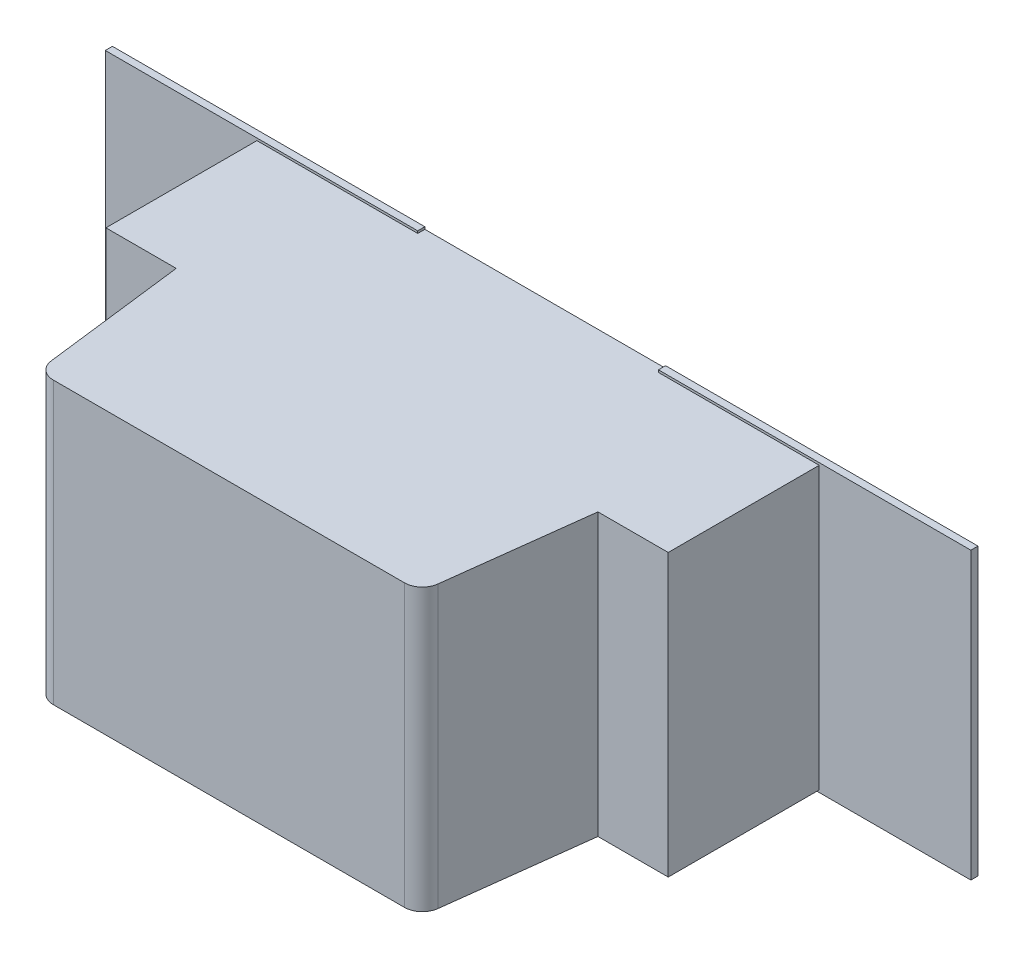
ISO-10303-21;
HEADER;
FILE_DESCRIPTION(('STEP AP214'),'2;1');
FILE_NAME('part.step','',(''),(''),'','','');
FILE_SCHEMA(('AUTOMOTIVE_DESIGN { 1 0 10303 214 1 1 1 1 }'));
ENDSEC;
DATA;
#1=APPLICATION_CONTEXT('core data for automotive mechanical design processes');
#2=APPLICATION_PROTOCOL_DEFINITION('international standard','automotive_design',2000,#1);
#3=PRODUCT_CONTEXT('',#1,'mechanical');
#4=PRODUCT('Part','Part','',(#3));
#5=PRODUCT_RELATED_PRODUCT_CATEGORY('part','',(#4));
#6=PRODUCT_DEFINITION_FORMATION('','',#4);
#7=PRODUCT_DEFINITION_CONTEXT('part definition',#1,'design');
#8=PRODUCT_DEFINITION('design','',#6,#7);
#9=PRODUCT_DEFINITION_SHAPE('','',#8);
#10=(LENGTH_UNIT() NAMED_UNIT(*) SI_UNIT(.MILLI.,.METRE.));
#11=(NAMED_UNIT(*) PLANE_ANGLE_UNIT() SI_UNIT($,.RADIAN.));
#12=(NAMED_UNIT(*) SI_UNIT($,.STERADIAN.) SOLID_ANGLE_UNIT());
#13=UNCERTAINTY_MEASURE_WITH_UNIT(LENGTH_MEASURE(1.E-05),#10,'distance_accuracy_value','');
#14=(GEOMETRIC_REPRESENTATION_CONTEXT(3) GLOBAL_UNCERTAINTY_ASSIGNED_CONTEXT((#13)) GLOBAL_UNIT_ASSIGNED_CONTEXT((#10,
#11,#12)) REPRESENTATION_CONTEXT('',''));
#15=CARTESIAN_POINT('',(0.,0.,0.));
#16=DIRECTION('',(0.,0.,1.));
#17=DIRECTION('',(1.,0.,0.));
#18=AXIS2_PLACEMENT_3D('',#15,#16,#17);
#19=CARTESIAN_POINT('',(1.2314936,0.4065016,0.0762));
#20=DIRECTION('',(0.,1.,0.));
#21=DIRECTION('',(1.,0.,0.));
#22=AXIS2_PLACEMENT_3D('',#19,#20,#21);
#23=PLANE('',#22);
#24=DIRECTION('',(-1.,0.,0.));
#25=VECTOR('',#24,1.);
#26=CARTESIAN_POINT('',(1.2314936,0.4065016,0.0762));
#27=LINE('',#26,#25);
#28=CARTESIAN_POINT('',(1.2314936,0.4065016,0.0762));
#29=VERTEX_POINT('',#28);
#30=CARTESIAN_POINT('',(0.3424936,0.4065016,0.0762));
#31=VERTEX_POINT('',#30);
#32=EDGE_CURVE('E187',#29,#31,#27,.T.);
#33=ORIENTED_EDGE('',*,*,#32,.T.);
#34=DIRECTION('',(0.,0.,1.));
#35=VECTOR('',#34,1.);
#36=CARTESIAN_POINT('',(0.3424936,0.4065016,0.0762));
#37=LINE('',#36,#35);
#38=CARTESIAN_POINT('',(0.3424936,0.4065016,0.09652));
#39=VERTEX_POINT('',#38);
#40=EDGE_CURVE('E219',#31,#39,#37,.T.);
#41=ORIENTED_EDGE('',*,*,#40,.T.);
#42=DIRECTION('',(-1.,0.,0.));
#43=VECTOR('',#42,1.);
#44=CARTESIAN_POINT('',(1.2314936,0.4065016,0.09652));
#45=LINE('',#44,#43);
#46=CARTESIAN_POINT('',(1.2314936,0.4065016,0.09652));
#47=VERTEX_POINT('',#46);
#48=EDGE_CURVE('E190',#47,#39,#45,.T.);
#49=ORIENTED_EDGE('',*,*,#48,.F.);
#50=DIRECTION('',(0.,0.,1.));
#51=VECTOR('',#50,1.);
#52=CARTESIAN_POINT('',(1.2314936,0.4065016,0.0762));
#53=LINE('',#52,#51);
#54=EDGE_CURVE('E11',#29,#47,#53,.T.);
#55=ORIENTED_EDGE('',*,*,#54,.F.);
#56=EDGE_LOOP('',(#33,#41,#49,#55));
#57=FACE_BOUND('',#56,.T.);
#58=ADVANCED_FACE('F16',(#57),#23,.T.);
#59=CARTESIAN_POINT('',(1.2314936,-0.4065016,0.0762));
#60=DIRECTION('',(1.,0.,0.));
#61=DIRECTION('',(0.,1.,0.));
#62=AXIS2_PLACEMENT_3D('',#59,#60,#61);
#63=PLANE('',#62);
#64=DIRECTION('',(0.,1.,0.));
#65=VECTOR('',#64,1.);
#66=CARTESIAN_POINT('',(1.2314936,-0.4065016,0.0762));
#67=LINE('',#66,#65);
#68=CARTESIAN_POINT('',(1.2314936,-0.4065016,0.0762));
#69=VERTEX_POINT('',#68);
#70=EDGE_CURVE('E195',#69,#29,#67,.T.);
#71=ORIENTED_EDGE('',*,*,#70,.T.);
#72=ORIENTED_EDGE('',*,*,#54,.T.);
#73=DIRECTION('',(0.,1.,0.));
#74=VECTOR('',#73,1.);
#75=CARTESIAN_POINT('',(1.2314936,-0.4065016,0.09652));
#76=LINE('',#75,#74);
#77=CARTESIAN_POINT('',(1.2314936,-0.4065016,0.09652));
#78=VERTEX_POINT('',#77);
#79=EDGE_CURVE('E269',#78,#47,#76,.T.);
#80=ORIENTED_EDGE('',*,*,#79,.F.);
#81=DIRECTION('',(0.,0.,1.));
#82=VECTOR('',#81,1.);
#83=CARTESIAN_POINT('',(1.2314936,-0.4065016,0.0762));
#84=LINE('',#83,#82);
#85=EDGE_CURVE('E27',#69,#78,#84,.T.);
#86=ORIENTED_EDGE('',*,*,#85,.F.);
#87=EDGE_LOOP('',(#71,#72,#80,#86));
#88=FACE_BOUND('',#87,.T.);
#89=ADVANCED_FACE('F196',(#88),#63,.T.);
#90=CARTESIAN_POINT('',(0.3424936,-0.4065016,0.0762));
#91=DIRECTION('',(0.,-1.,0.));
#92=DIRECTION('',(0.,0.,-1.));
#93=AXIS2_PLACEMENT_3D('',#90,#91,#92);
#94=PLANE('',#93);
#95=DIRECTION('',(1.,0.,0.));
#96=VECTOR('',#95,1.);
#97=CARTESIAN_POINT('',(0.3424936,-0.4065016,0.0762));
#98=LINE('',#97,#96);
#99=CARTESIAN_POINT('',(0.3424936,-0.4065016,0.0762));
#100=VERTEX_POINT('',#99);
#101=EDGE_CURVE('E201',#100,#69,#98,.T.);
#102=ORIENTED_EDGE('',*,*,#101,.T.);
#103=ORIENTED_EDGE('',*,*,#85,.T.);
#104=DIRECTION('',(1.,0.,0.));
#105=VECTOR('',#104,1.);
#106=CARTESIAN_POINT('',(0.3424936,-0.4065016,0.09652));
#107=LINE('',#106,#105);
#108=CARTESIAN_POINT('',(0.3424936,-0.4065016,0.09652));
#109=VERTEX_POINT('',#108);
#110=EDGE_CURVE('E265',#109,#78,#107,.T.);
#111=ORIENTED_EDGE('',*,*,#110,.F.);
#112=DIRECTION('',(0.,0.,1.));
#113=VECTOR('',#112,1.);
#114=CARTESIAN_POINT('',(0.3424936,-0.4065016,0.0762));
#115=LINE('',#114,#113);
#116=EDGE_CURVE('E237',#100,#109,#115,.T.);
#117=ORIENTED_EDGE('',*,*,#116,.F.);
#118=EDGE_LOOP('',(#102,#103,#111,#117));
#119=FACE_BOUND('',#118,.T.);
#120=ADVANCED_FACE('F479',(#119),#94,.T.);
#121=CARTESIAN_POINT('',(0.3424936,0.4065016,0.0762));
#122=DIRECTION('',(-1.,0.,0.));
#123=DIRECTION('',(0.,0.,1.));
#124=AXIS2_PLACEMENT_3D('',#121,#122,#123);
#125=PLANE('',#124);
#126=DIRECTION('',(0.,0.,1.));
#127=VECTOR('',#126,1.);
#128=CARTESIAN_POINT('',(0.3424936,0.4,0.0762));
#129=LINE('',#128,#127);
#130=CARTESIAN_POINT('',(0.3424936,0.4,0.0762));
#131=VERTEX_POINT('',#130);
#132=CARTESIAN_POINT('',(0.3424936,0.4,0.09652));
#133=VERTEX_POINT('',#132);
#134=EDGE_CURVE('E229',#131,#133,#129,.T.);
#135=ORIENTED_EDGE('',*,*,#134,.T.);
#136=DIRECTION('',(0.,-1.,0.));
#137=VECTOR('',#136,1.);
#138=CARTESIAN_POINT('',(0.3424936,0.4065016,0.09652));
#139=LINE('',#138,#137);
#140=EDGE_CURVE('E309',#39,#133,#139,.T.);
#141=ORIENTED_EDGE('',*,*,#140,.F.);
#142=ORIENTED_EDGE('',*,*,#40,.F.);
#143=DIRECTION('',(0.,-1.,0.));
#144=VECTOR('',#143,1.);
#145=CARTESIAN_POINT('',(0.3424936,0.4065016,0.0762));
#146=LINE('',#145,#144);
#147=EDGE_CURVE('E205',#31,#131,#146,.T.);
#148=ORIENTED_EDGE('',*,*,#147,.T.);
#149=EDGE_LOOP('',(#135,#141,#142,#148));
#150=FACE_BOUND('',#149,.T.);
#151=ADVANCED_FACE('F575',(#150),#125,.T.);
#152=CARTESIAN_POINT('',(0.3424936,0.4065016,0.0762));
#153=DIRECTION('',(-1.,0.,0.));
#154=DIRECTION('',(0.,0.,1.));
#155=AXIS2_PLACEMENT_3D('',#152,#153,#154);
#156=PLANE('',#155);
#157=DIRECTION('',(0.,0.,1.));
#158=VECTOR('',#157,1.);
#159=CARTESIAN_POINT('',(0.3424936,-0.4,0.0762));
#160=LINE('',#159,#158);
#161=CARTESIAN_POINT('',(0.3424936,-0.4,0.0762));
#162=VERTEX_POINT('',#161);
#163=CARTESIAN_POINT('',(0.3424936,-0.4,0.09652));
#164=VERTEX_POINT('',#163);
#165=EDGE_CURVE('E224',#162,#164,#160,.T.);
#166=ORIENTED_EDGE('',*,*,#165,.F.);
#167=DIRECTION('',(0.,-1.,0.));
#168=VECTOR('',#167,1.);
#169=CARTESIAN_POINT('',(0.3424936,-0.4,0.0762));
#170=LINE('',#169,#168);
#171=EDGE_CURVE('E233',#162,#100,#170,.T.);
#172=ORIENTED_EDGE('',*,*,#171,.T.);
#173=ORIENTED_EDGE('',*,*,#116,.T.);
#174=DIRECTION('',(0.,-1.,0.));
#175=VECTOR('',#174,1.);
#176=CARTESIAN_POINT('',(0.3424936,-0.4,0.09652));
#177=LINE('',#176,#175);
#178=EDGE_CURVE('E270',#164,#109,#177,.T.);
#179=ORIENTED_EDGE('',*,*,#178,.F.);
#180=EDGE_LOOP('',(#166,#172,#173,#179));
#181=FACE_BOUND('',#180,.T.);
#182=ADVANCED_FACE('F485',(#181),#156,.T.);
#183=CARTESIAN_POINT('',(-1.2314936,-0.4065016,0.0762));
#184=DIRECTION('',(0.,-1.,0.));
#185=DIRECTION('',(0.,0.,-1.));
#186=AXIS2_PLACEMENT_3D('',#183,#184,#185);
#187=PLANE('',#186);
#188=DIRECTION('',(1.,0.,0.));
#189=VECTOR('',#188,1.);
#190=CARTESIAN_POINT('',(-1.2314936,-0.4065016,0.0762));
#191=LINE('',#190,#189);
#192=CARTESIAN_POINT('',(-1.2314936,-0.4065016,0.0762));
#193=VERTEX_POINT('',#192);
#194=CARTESIAN_POINT('',(-0.3424936,-0.4065016,0.0762));
#195=VERTEX_POINT('',#194);
#196=EDGE_CURVE('E253',#193,#195,#191,.T.);
#197=ORIENTED_EDGE('',*,*,#196,.T.);
#198=DIRECTION('',(0.,0.,1.));
#199=VECTOR('',#198,1.);
#200=CARTESIAN_POINT('',(-0.3424936,-0.4065016,0.0762));
#201=LINE('',#200,#199);
#202=CARTESIAN_POINT('',(-0.3424936,-0.4065016,0.09652));
#203=VERTEX_POINT('',#202);
#204=EDGE_CURVE('E300',#195,#203,#201,.T.);
#205=ORIENTED_EDGE('',*,*,#204,.T.);
#206=DIRECTION('',(1.,0.,0.));
#207=VECTOR('',#206,1.);
#208=CARTESIAN_POINT('',(-1.2314936,-0.4065016,0.09652));
#209=LINE('',#208,#207);
#210=CARTESIAN_POINT('',(-1.2314936,-0.4065016,0.09652));
#211=VERTEX_POINT('',#210);
#212=EDGE_CURVE('E276',#211,#203,#209,.T.);
#213=ORIENTED_EDGE('',*,*,#212,.F.);
#214=DIRECTION('',(0.,0.,1.));
#215=VECTOR('',#214,1.);
#216=CARTESIAN_POINT('',(-1.2314936,-0.4065016,0.0762));
#217=LINE('',#216,#215);
#218=EDGE_CURVE('E234',#193,#211,#217,.T.);
#219=ORIENTED_EDGE('',*,*,#218,.F.);
#220=EDGE_LOOP('',(#197,#205,#213,#219));
#221=FACE_BOUND('',#220,.T.);
#222=ADVANCED_FACE('F496',(#221),#187,.T.);
#223=CARTESIAN_POINT('',(-1.2314936,0.4065016,0.0762));
#224=DIRECTION('',(-1.,0.,0.));
#225=DIRECTION('',(0.,0.,1.));
#226=AXIS2_PLACEMENT_3D('',#223,#224,#225);
#227=PLANE('',#226);
#228=DIRECTION('',(0.,-1.,0.));
#229=VECTOR('',#228,1.);
#230=CARTESIAN_POINT('',(-1.2314936,0.4065016,0.0762));
#231=LINE('',#230,#229);
#232=CARTESIAN_POINT('',(-1.2314936,0.4065016,0.0762));
#233=VERTEX_POINT('',#232);
#234=EDGE_CURVE('E249',#233,#193,#231,.T.);
#235=ORIENTED_EDGE('',*,*,#234,.T.);
#236=ORIENTED_EDGE('',*,*,#218,.T.);
#237=DIRECTION('',(0.,-1.,0.));
#238=VECTOR('',#237,1.);
#239=CARTESIAN_POINT('',(-1.2314936,0.4065016,0.09652));
#240=LINE('',#239,#238);
#241=CARTESIAN_POINT('',(-1.2314936,0.4065016,0.09652));
#242=VERTEX_POINT('',#241);
#243=EDGE_CURVE('E332',#242,#211,#240,.T.);
#244=ORIENTED_EDGE('',*,*,#243,.F.);
#245=DIRECTION('',(0.,0.,1.));
#246=VECTOR('',#245,1.);
#247=CARTESIAN_POINT('',(-1.2314936,0.4065016,0.0762));
#248=LINE('',#247,#246);
#249=EDGE_CURVE('E41',#233,#242,#248,.T.);
#250=ORIENTED_EDGE('',*,*,#249,.F.);
#251=EDGE_LOOP('',(#235,#236,#244,#250));
#252=FACE_BOUND('',#251,.T.);
#253=ADVANCED_FACE('F498',(#252),#227,.T.);
#254=CARTESIAN_POINT('',(-0.3424936,0.4065016,0.0762));
#255=DIRECTION('',(0.,1.,0.));
#256=DIRECTION('',(1.,0.,0.));
#257=AXIS2_PLACEMENT_3D('',#254,#255,#256);
#258=PLANE('',#257);
#259=DIRECTION('',(-1.,0.,0.));
#260=VECTOR('',#259,1.);
#261=CARTESIAN_POINT('',(-0.3424936,0.4065016,0.0762));
#262=LINE('',#261,#260);
#263=CARTESIAN_POINT('',(-0.3424936,0.4065016,0.0762));
#264=VERTEX_POINT('',#263);
#265=EDGE_CURVE('E252',#264,#233,#262,.T.);
#266=ORIENTED_EDGE('',*,*,#265,.T.);
#267=ORIENTED_EDGE('',*,*,#249,.T.);
#268=DIRECTION('',(-1.,0.,0.));
#269=VECTOR('',#268,1.);
#270=CARTESIAN_POINT('',(-0.3424936,0.4065016,0.09652));
#271=LINE('',#270,#269);
#272=CARTESIAN_POINT('',(-0.3424936,0.4065016,0.09652));
#273=VERTEX_POINT('',#272);
#274=EDGE_CURVE('E20',#273,#242,#271,.T.);
#275=ORIENTED_EDGE('',*,*,#274,.F.);
#276=DIRECTION('',(0.,0.,1.));
#277=VECTOR('',#276,1.);
#278=CARTESIAN_POINT('',(-0.3424936,0.4065016,0.0762));
#279=LINE('',#278,#277);
#280=EDGE_CURVE('E212',#264,#273,#279,.T.);
#281=ORIENTED_EDGE('',*,*,#280,.F.);
#282=EDGE_LOOP('',(#266,#267,#275,#281));
#283=FACE_BOUND('',#282,.T.);
#284=ADVANCED_FACE('F18',(#283),#258,.T.);
#285=CARTESIAN_POINT('',(0.8,-0.4,0.0762));
#286=DIRECTION('',(0.,0.,-1.));
#287=DIRECTION('',(0.,-1.,0.));
#288=AXIS2_PLACEMENT_3D('',#285,#286,#287);
#289=PLANE('',#288);
#290=DIRECTION('',(-1.,0.,0.));
#291=VECTOR('',#290,1.);
#292=CARTESIAN_POINT('',(0.3424936,0.4,0.0762));
#293=LINE('',#292,#291);
#294=CARTESIAN_POINT('',(-0.3424936,0.4,0.0762));
#295=VERTEX_POINT('',#294);
#296=EDGE_CURVE('E301',#131,#295,#293,.T.);
#297=ORIENTED_EDGE('',*,*,#296,.F.);
#298=ORIENTED_EDGE('',*,*,#147,.F.);
#299=ORIENTED_EDGE('',*,*,#32,.F.);
#300=ORIENTED_EDGE('',*,*,#70,.F.);
#301=ORIENTED_EDGE('',*,*,#101,.F.);
#302=ORIENTED_EDGE('',*,*,#171,.F.);
#303=DIRECTION('',(-1.,0.,0.));
#304=VECTOR('',#303,1.);
#305=CARTESIAN_POINT('',(0.3424936,-0.4,0.0762));
#306=LINE('',#305,#304);
#307=CARTESIAN_POINT('',(-0.3424936,-0.4,0.0762));
#308=VERTEX_POINT('',#307);
#309=EDGE_CURVE('E220',#162,#308,#306,.T.);
#310=ORIENTED_EDGE('',*,*,#309,.T.);
#311=DIRECTION('',(0.,1.,0.));
#312=VECTOR('',#311,1.);
#313=CARTESIAN_POINT('',(-0.3424936,-0.4065016,0.0762));
#314=LINE('',#313,#312);
#315=EDGE_CURVE('E449',#195,#308,#314,.T.);
#316=ORIENTED_EDGE('',*,*,#315,.F.);
#317=ORIENTED_EDGE('',*,*,#196,.F.);
#318=ORIENTED_EDGE('',*,*,#234,.F.);
#319=ORIENTED_EDGE('',*,*,#265,.F.);
#320=DIRECTION('',(0.,1.,0.));
#321=VECTOR('',#320,1.);
#322=CARTESIAN_POINT('',(-0.3424936,0.4,0.0762));
#323=LINE('',#322,#321);
#324=EDGE_CURVE('E368',#295,#264,#323,.T.);
#325=ORIENTED_EDGE('',*,*,#324,.F.);
#326=EDGE_LOOP('',(#297,#298,#299,#300,#301,#302,#310,#316,#317,#318,#319,#325));
#327=FACE_BOUND('',#326,.T.);
#328=ADVANCED_FACE('F204',(#327),#289,.T.);
#329=CARTESIAN_POINT('',(-0.3424936,-0.4065016,0.0762));
#330=DIRECTION('',(1.,0.,0.));
#331=DIRECTION('',(0.,1.,0.));
#332=AXIS2_PLACEMENT_3D('',#329,#330,#331);
#333=PLANE('',#332);
#334=DIRECTION('',(0.,0.,1.));
#335=VECTOR('',#334,1.);
#336=CARTESIAN_POINT('',(-0.3424936,0.4,0.0762));
#337=LINE('',#336,#335);
#338=CARTESIAN_POINT('',(-0.3424936,0.4,0.09652));
#339=VERTEX_POINT('',#338);
#340=EDGE_CURVE('E297',#295,#339,#337,.T.);
#341=ORIENTED_EDGE('',*,*,#340,.F.);
#342=ORIENTED_EDGE('',*,*,#324,.T.);
#343=ORIENTED_EDGE('',*,*,#280,.T.);
#344=DIRECTION('',(0.,1.,0.));
#345=VECTOR('',#344,1.);
#346=CARTESIAN_POINT('',(-0.3424936,0.4,0.09652));
#347=LINE('',#346,#345);
#348=EDGE_CURVE('E258',#339,#273,#347,.T.);
#349=ORIENTED_EDGE('',*,*,#348,.F.);
#350=EDGE_LOOP('',(#341,#342,#343,#349));
#351=FACE_BOUND('',#350,.T.);
#352=ADVANCED_FACE('F518',(#351),#333,.T.);
#353=CARTESIAN_POINT('',(-0.3424936,-0.4065016,0.0762));
#354=DIRECTION('',(1.,0.,0.));
#355=DIRECTION('',(0.,1.,0.));
#356=AXIS2_PLACEMENT_3D('',#353,#354,#355);
#357=PLANE('',#356);
#358=DIRECTION('',(0.,0.,1.));
#359=VECTOR('',#358,1.);
#360=CARTESIAN_POINT('',(-0.3424936,-0.4,0.0762));
#361=LINE('',#360,#359);
#362=CARTESIAN_POINT('',(-0.3424936,-0.4,0.09652));
#363=VERTEX_POINT('',#362);
#364=EDGE_CURVE('E225',#308,#363,#361,.T.);
#365=ORIENTED_EDGE('',*,*,#364,.T.);
#366=DIRECTION('',(0.,1.,0.));
#367=VECTOR('',#366,1.);
#368=CARTESIAN_POINT('',(-0.3424936,-0.4065016,0.09652));
#369=LINE('',#368,#367);
#370=EDGE_CURVE('E271',#203,#363,#369,.T.);
#371=ORIENTED_EDGE('',*,*,#370,.F.);
#372=ORIENTED_EDGE('',*,*,#204,.F.);
#373=ORIENTED_EDGE('',*,*,#315,.T.);
#374=EDGE_LOOP('',(#365,#371,#372,#373));
#375=FACE_BOUND('',#374,.T.);
#376=ADVANCED_FACE('F490',(#375),#357,.T.);
#377=CARTESIAN_POINT('',(0.,0.4,0.0762));
#378=DIRECTION('',(0.,1.,0.));
#379=DIRECTION('',(1.,0.,0.));
#380=AXIS2_PLACEMENT_3D('',#377,#378,#379);
#381=PLANE('',#380);
#382=DIRECTION('',(-1.,0.,0.));
#383=VECTOR('',#382,1.);
#384=CARTESIAN_POINT('',(0.8,0.4,0.09652));
#385=LINE('',#384,#383);
#386=CARTESIAN_POINT('',(0.8,0.4,0.09652));
#387=VERTEX_POINT('',#386);
#388=EDGE_CURVE('E304',#387,#133,#385,.T.);
#389=ORIENTED_EDGE('',*,*,#388,.T.);
#390=ORIENTED_EDGE('',*,*,#134,.F.);
#391=ORIENTED_EDGE('',*,*,#296,.T.);
#392=ORIENTED_EDGE('',*,*,#340,.T.);
#393=DIRECTION('',(-1.,0.,0.));
#394=VECTOR('',#393,1.);
#395=CARTESIAN_POINT('',(-0.3424936,0.4,0.09652));
#396=LINE('',#395,#394);
#397=CARTESIAN_POINT('',(-0.8,0.4,0.09652));
#398=VERTEX_POINT('',#397);
#399=EDGE_CURVE('E254',#339,#398,#396,.T.);
#400=ORIENTED_EDGE('',*,*,#399,.T.);
#401=DIRECTION('',(0.,0.,1.));
#402=VECTOR('',#401,1.);
#403=CARTESIAN_POINT('',(-0.8,0.4,0.09652));
#404=LINE('',#403,#402);
#405=CARTESIAN_POINT('',(-0.8,0.4,0.5262));
#406=VERTEX_POINT('',#405);
#407=EDGE_CURVE('E226',#398,#406,#404,.T.);
#408=ORIENTED_EDGE('',*,*,#407,.T.);
#409=DIRECTION('',(1.,0.,0.));
#410=VECTOR('',#409,1.);
#411=CARTESIAN_POINT('',(-0.8,0.4,0.5262));
#412=LINE('',#411,#410);
#413=CARTESIAN_POINT('',(-0.6,0.4,0.5262));
#414=VERTEX_POINT('',#413);
#415=EDGE_CURVE('E285',#406,#414,#412,.T.);
#416=ORIENTED_EDGE('',*,*,#415,.T.);
#417=DIRECTION('',(0.122402128164196,0.,0.992480588737571));
#418=VECTOR('',#417,1.);
#419=CARTESIAN_POINT('',(-0.6,0.4,0.5262));
#420=LINE('',#419,#418);
#421=CARTESIAN_POINT('',(-0.55,0.4,0.9316180281107));
#422=VERTEX_POINT('',#421);
#423=EDGE_CURVE('E353',#414,#422,#420,.T.);
#424=ORIENTED_EDGE('',*,*,#423,.T.);
#425=CARTESIAN_POINT('',(-0.4995819860921,0.4,0.9254));
#426=DIRECTION('',(0.,1.,0.));
#427=DIRECTION('',(-0.992480588737571,0.,0.122402128164196));
#428=AXIS2_PLACEMENT_3D('',#425,#426,#427);
#429=CIRCLE('',#428,0.0508);
#430=CARTESIAN_POINT('',(-0.4995819860921,0.4,0.9762));
#431=VERTEX_POINT('',#430);
#432=EDGE_CURVE('E277',#422,#431,#429,.T.);
#433=ORIENTED_EDGE('',*,*,#432,.T.);
#434=DIRECTION('',(1.,0.,0.));
#435=VECTOR('',#434,1.);
#436=CARTESIAN_POINT('',(-0.4995819860921,0.4,0.9762));
#437=LINE('',#436,#435);
#438=CARTESIAN_POINT('',(0.4995819860921,0.4,0.9762));
#439=VERTEX_POINT('',#438);
#440=EDGE_CURVE('E310',#431,#439,#437,.T.);
#441=ORIENTED_EDGE('',*,*,#440,.T.);
#442=CARTESIAN_POINT('',(0.4995819860921,0.4,0.9254));
#443=DIRECTION('',(0.,1.,0.));
#444=DIRECTION('',(0.,0.,1.));
#445=AXIS2_PLACEMENT_3D('',#442,#443,#444);
#446=CIRCLE('',#445,0.0508);
#447=CARTESIAN_POINT('',(0.55,0.4,0.9316180281107));
#448=VERTEX_POINT('',#447);
#449=EDGE_CURVE('E343',#439,#448,#446,.T.);
#450=ORIENTED_EDGE('',*,*,#449,.T.);
#451=DIRECTION('',(0.122402128164196,0.,-0.992480588737571));
#452=VECTOR('',#451,1.);
#453=CARTESIAN_POINT('',(0.55,0.4,0.9316180281107));
#454=LINE('',#453,#452);
#455=CARTESIAN_POINT('',(0.6,0.4,0.5262));
#456=VERTEX_POINT('',#455);
#457=EDGE_CURVE('E344',#448,#456,#454,.T.);
#458=ORIENTED_EDGE('',*,*,#457,.T.);
#459=DIRECTION('',(1.,0.,0.));
#460=VECTOR('',#459,1.);
#461=CARTESIAN_POINT('',(0.6,0.4,0.5262));
#462=LINE('',#461,#460);
#463=CARTESIAN_POINT('',(0.8,0.4,0.5262));
#464=VERTEX_POINT('',#463);
#465=EDGE_CURVE('E260',#456,#464,#462,.T.);
#466=ORIENTED_EDGE('',*,*,#465,.T.);
#467=DIRECTION('',(0.,0.,-1.));
#468=VECTOR('',#467,1.);
#469=CARTESIAN_POINT('',(0.8,0.4,0.5262));
#470=LINE('',#469,#468);
#471=EDGE_CURVE('E275',#464,#387,#470,.T.);
#472=ORIENTED_EDGE('',*,*,#471,.T.);
#473=EDGE_LOOP('',(#389,#390,#391,#392,#400,#408,#416,#424,#433,#441,#450,#458,#466,#472));
#474=FACE_BOUND('',#473,.T.);
#475=ADVANCED_FACE('F410',(#474),#381,.T.);
#476=CARTESIAN_POINT('',(-0.8,-0.4,0.0762));
#477=DIRECTION('',(-1.,0.,0.));
#478=DIRECTION('',(0.,0.,1.));
#479=AXIS2_PLACEMENT_3D('',#476,#477,#478);
#480=PLANE('',#479);
#481=DIRECTION('',(0.,1.,0.));
#482=VECTOR('',#481,1.);
#483=CARTESIAN_POINT('',(-0.8,-0.4,0.09652));
#484=LINE('',#483,#482);
#485=CARTESIAN_POINT('',(-0.8,-0.4,0.09652));
#486=VERTEX_POINT('',#485);
#487=EDGE_CURVE('E259',#486,#398,#484,.T.);
#488=ORIENTED_EDGE('',*,*,#487,.F.);
#489=DIRECTION('',(0.,0.,1.));
#490=VECTOR('',#489,1.);
#491=CARTESIAN_POINT('',(-0.8,-0.4,0.09652));
#492=LINE('',#491,#490);
#493=CARTESIAN_POINT('',(-0.8,-0.4,0.5262));
#494=VERTEX_POINT('',#493);
#495=EDGE_CURVE('E330',#486,#494,#492,.T.);
#496=ORIENTED_EDGE('',*,*,#495,.T.);
#497=DIRECTION('',(0.,1.,0.));
#498=VECTOR('',#497,1.);
#499=CARTESIAN_POINT('',(-0.8,-0.4,0.5262));
#500=LINE('',#499,#498);
#501=EDGE_CURVE('E230',#494,#406,#500,.T.);
#502=ORIENTED_EDGE('',*,*,#501,.T.);
#503=ORIENTED_EDGE('',*,*,#407,.F.);
#504=EDGE_LOOP('',(#488,#496,#502,#503));
#505=FACE_BOUND('',#504,.T.);
#506=ADVANCED_FACE('F551',(#505),#480,.T.);
#507=CARTESIAN_POINT('',(-0.8,-0.4,0.5262));
#508=DIRECTION('',(0.,0.,1.));
#509=DIRECTION('',(1.,0.,0.));
#510=AXIS2_PLACEMENT_3D('',#507,#508,#509);
#511=PLANE('',#510);
#512=DIRECTION('',(1.,0.,0.));
#513=VECTOR('',#512,1.);
#514=CARTESIAN_POINT('',(-0.8,-0.4,0.5262));
#515=LINE('',#514,#513);
#516=CARTESIAN_POINT('',(-0.6,-0.4,0.5262));
#517=VERTEX_POINT('',#516);
#518=EDGE_CURVE('E323',#494,#517,#515,.T.);
#519=ORIENTED_EDGE('',*,*,#518,.T.);
#520=DIRECTION('',(0.,1.,0.));
#521=VECTOR('',#520,1.);
#522=CARTESIAN_POINT('',(-0.6,-0.4,0.5262));
#523=LINE('',#522,#521);
#524=EDGE_CURVE('E338',#517,#414,#523,.T.);
#525=ORIENTED_EDGE('',*,*,#524,.T.);
#526=ORIENTED_EDGE('',*,*,#415,.F.);
#527=ORIENTED_EDGE('',*,*,#501,.F.);
#528=EDGE_LOOP('',(#519,#525,#526,#527));
#529=FACE_BOUND('',#528,.T.);
#530=ADVANCED_FACE('F554',(#529),#511,.T.);
#531=CARTESIAN_POINT('',(-0.6,-0.4,0.5262));
#532=DIRECTION('',(-0.992480588737571,0.,0.122402128164196));
#533=DIRECTION('',(0.,1.,0.));
#534=AXIS2_PLACEMENT_3D('',#531,#532,#533);
#535=PLANE('',#534);
#536=DIRECTION('',(0.122402128164196,0.,0.992480588737571));
#537=VECTOR('',#536,1.);
#538=CARTESIAN_POINT('',(-0.6,-0.4,0.5262));
#539=LINE('',#538,#537);
#540=CARTESIAN_POINT('',(-0.55,-0.4,0.9316180281107));
#541=VERTEX_POINT('',#540);
#542=EDGE_CURVE('E319',#517,#541,#539,.T.);
#543=ORIENTED_EDGE('',*,*,#542,.T.);
#544=DIRECTION('',(0.,1.,0.));
#545=VECTOR('',#544,1.);
#546=CARTESIAN_POINT('',(-0.55,-0.4,0.9316180281107));
#547=LINE('',#546,#545);
#548=EDGE_CURVE('E280',#541,#422,#547,.T.);
#549=ORIENTED_EDGE('',*,*,#548,.T.);
#550=ORIENTED_EDGE('',*,*,#423,.F.);
#551=ORIENTED_EDGE('',*,*,#524,.F.);
#552=EDGE_LOOP('',(#543,#549,#550,#551));
#553=FACE_BOUND('',#552,.T.);
#554=ADVANCED_FACE('F435',(#553),#535,.T.);
#555=CARTESIAN_POINT('',(-0.4995819860921,-0.4,0.9254));
#556=DIRECTION('',(0.,1.,0.));
#557=DIRECTION('',(-1.,0.,0.));
#558=AXIS2_PLACEMENT_3D('',#555,#556,#557);
#559=CYLINDRICAL_SURFACE('',#558,0.0508);
#560=CARTESIAN_POINT('',(-0.4995819860921,-0.4,0.9254));
#561=DIRECTION('',(0.,1.,0.));
#562=DIRECTION('',(-0.992480588737571,0.,0.122402128164196));
#563=AXIS2_PLACEMENT_3D('',#560,#561,#562);
#564=CIRCLE('',#563,0.0508);
#565=CARTESIAN_POINT('',(-0.4995819860921,-0.4,0.9762));
#566=VERTEX_POINT('',#565);
#567=EDGE_CURVE('E324',#541,#566,#564,.T.);
#568=ORIENTED_EDGE('',*,*,#567,.T.);
#569=DIRECTION('',(0.,1.,0.));
#570=VECTOR('',#569,1.);
#571=CARTESIAN_POINT('',(-0.4995819860921,-0.4,0.9762));
#572=LINE('',#571,#570);
#573=EDGE_CURVE('E281',#566,#431,#572,.T.);
#574=ORIENTED_EDGE('',*,*,#573,.T.);
#575=ORIENTED_EDGE('',*,*,#432,.F.);
#576=ORIENTED_EDGE('',*,*,#548,.F.);
#577=EDGE_LOOP('',(#568,#574,#575,#576));
#578=FACE_BOUND('',#577,.T.);
#579=ADVANCED_FACE('F406',(#578),#559,.T.);
#580=CARTESIAN_POINT('',(-0.4995819860921,-0.4,0.9762));
#581=DIRECTION('',(0.,0.,1.));
#582=DIRECTION('',(1.,0.,0.));
#583=AXIS2_PLACEMENT_3D('',#580,#581,#582);
#584=PLANE('',#583);
#585=DIRECTION('',(1.,0.,0.));
#586=VECTOR('',#585,1.);
#587=CARTESIAN_POINT('',(-0.4995819860921,-0.4,0.9762));
#588=LINE('',#587,#586);
#589=CARTESIAN_POINT('',(0.4995819860921,-0.4,0.9762));
#590=VERTEX_POINT('',#589);
#591=EDGE_CURVE('E357',#566,#590,#588,.T.);
#592=ORIENTED_EDGE('',*,*,#591,.T.);
#593=DIRECTION('',(0.,1.,0.));
#594=VECTOR('',#593,1.);
#595=CARTESIAN_POINT('',(0.4995819860921,-0.4,0.9762));
#596=LINE('',#595,#594);
#597=EDGE_CURVE('E314',#590,#439,#596,.T.);
#598=ORIENTED_EDGE('',*,*,#597,.T.);
#599=ORIENTED_EDGE('',*,*,#440,.F.);
#600=ORIENTED_EDGE('',*,*,#573,.F.);
#601=EDGE_LOOP('',(#592,#598,#599,#600));
#602=FACE_BOUND('',#601,.T.);
#603=ADVANCED_FACE('F409',(#602),#584,.T.);
#604=CARTESIAN_POINT('',(0.4995819860921,-0.4,0.9254));
#605=DIRECTION('',(0.,1.,0.));
#606=DIRECTION('',(-1.,0.,0.));
#607=AXIS2_PLACEMENT_3D('',#604,#605,#606);
#608=CYLINDRICAL_SURFACE('',#607,0.0508);
#609=CARTESIAN_POINT('',(0.4995819860921,-0.4,0.9254));
#610=DIRECTION('',(0.,1.,0.));
#611=DIRECTION('',(0.,0.,1.));
#612=AXIS2_PLACEMENT_3D('',#609,#610,#611);
#613=CIRCLE('',#612,0.0508);
#614=CARTESIAN_POINT('',(0.55,-0.4,0.9316180281107));
#615=VERTEX_POINT('',#614);
#616=EDGE_CURVE('E349',#590,#615,#613,.T.);
#617=ORIENTED_EDGE('',*,*,#616,.T.);
#618=DIRECTION('',(0.,1.,0.));
#619=VECTOR('',#618,1.);
#620=CARTESIAN_POINT('',(0.55,-0.4,0.9316180281107));
#621=LINE('',#620,#619);
#622=EDGE_CURVE('E339',#615,#448,#621,.T.);
#623=ORIENTED_EDGE('',*,*,#622,.T.);
#624=ORIENTED_EDGE('',*,*,#449,.F.);
#625=ORIENTED_EDGE('',*,*,#597,.F.);
#626=EDGE_LOOP('',(#617,#623,#624,#625));
#627=FACE_BOUND('',#626,.T.);
#628=ADVANCED_FACE('F531',(#627),#608,.T.);
#629=CARTESIAN_POINT('',(0.55,-0.4,0.9316180281107));
#630=DIRECTION('',(0.992480588737571,0.,0.122402128164196));
#631=DIRECTION('',(0.,-1.,0.));
#632=AXIS2_PLACEMENT_3D('',#629,#630,#631);
#633=PLANE('',#632);
#634=DIRECTION('',(0.122402128164196,0.,-0.992480588737571));
#635=VECTOR('',#634,1.);
#636=CARTESIAN_POINT('',(0.55,-0.4,0.9316180281107));
#637=LINE('',#636,#635);
#638=CARTESIAN_POINT('',(0.6,-0.4,0.5262));
#639=VERTEX_POINT('',#638);
#640=EDGE_CURVE('E345',#615,#639,#637,.T.);
#641=ORIENTED_EDGE('',*,*,#640,.T.);
#642=DIRECTION('',(0.,1.,0.));
#643=VECTOR('',#642,1.);
#644=CARTESIAN_POINT('',(0.6,-0.4,0.5262));
#645=LINE('',#644,#643);
#646=EDGE_CURVE('E263',#639,#456,#645,.T.);
#647=ORIENTED_EDGE('',*,*,#646,.T.);
#648=ORIENTED_EDGE('',*,*,#457,.F.);
#649=ORIENTED_EDGE('',*,*,#622,.F.);
#650=EDGE_LOOP('',(#641,#647,#648,#649));
#651=FACE_BOUND('',#650,.T.);
#652=ADVANCED_FACE('F522',(#651),#633,.T.);
#653=CARTESIAN_POINT('',(0.6,-0.4,0.5262));
#654=DIRECTION('',(0.,0.,1.));
#655=DIRECTION('',(1.,0.,0.));
#656=AXIS2_PLACEMENT_3D('',#653,#654,#655);
#657=PLANE('',#656);
#658=DIRECTION('',(1.,0.,0.));
#659=VECTOR('',#658,1.);
#660=CARTESIAN_POINT('',(0.6,-0.4,0.5262));
#661=LINE('',#660,#659);
#662=CARTESIAN_POINT('',(0.8,-0.4,0.5262));
#663=VERTEX_POINT('',#662);
#664=EDGE_CURVE('E216',#639,#663,#661,.T.);
#665=ORIENTED_EDGE('',*,*,#664,.T.);
#666=DIRECTION('',(0.,1.,0.));
#667=VECTOR('',#666,1.);
#668=CARTESIAN_POINT('',(0.8,-0.4,0.5262));
#669=LINE('',#668,#667);
#670=EDGE_CURVE('E264',#663,#464,#669,.T.);
#671=ORIENTED_EDGE('',*,*,#670,.T.);
#672=ORIENTED_EDGE('',*,*,#465,.F.);
#673=ORIENTED_EDGE('',*,*,#646,.F.);
#674=EDGE_LOOP('',(#665,#671,#672,#673));
#675=FACE_BOUND('',#674,.T.);
#676=ADVANCED_FACE('F519',(#675),#657,.T.);
#677=CARTESIAN_POINT('',(0.8,-0.4,0.5262));
#678=DIRECTION('',(1.,0.,0.));
#679=DIRECTION('',(0.,1.,0.));
#680=AXIS2_PLACEMENT_3D('',#677,#678,#679);
#681=PLANE('',#680);
#682=DIRECTION('',(0.,1.,0.));
#683=VECTOR('',#682,1.);
#684=CARTESIAN_POINT('',(0.8,-0.4,0.09652));
#685=LINE('',#684,#683);
#686=CARTESIAN_POINT('',(0.8,-0.4,0.09652));
#687=VERTEX_POINT('',#686);
#688=EDGE_CURVE('E308',#687,#387,#685,.T.);
#689=ORIENTED_EDGE('',*,*,#688,.T.);
#690=ORIENTED_EDGE('',*,*,#471,.F.);
#691=ORIENTED_EDGE('',*,*,#670,.F.);
#692=DIRECTION('',(0.,0.,-1.));
#693=VECTOR('',#692,1.);
#694=CARTESIAN_POINT('',(0.8,-0.4,0.5262));
#695=LINE('',#694,#693);
#696=EDGE_CURVE('E240',#663,#687,#695,.T.);
#697=ORIENTED_EDGE('',*,*,#696,.T.);
#698=EDGE_LOOP('',(#689,#690,#691,#697));
#699=FACE_BOUND('',#698,.T.);
#700=ADVANCED_FACE('F521',(#699),#681,.T.);
#701=CARTESIAN_POINT('',(0.,0.,0.09652));
#702=DIRECTION('',(0.,0.,1.));
#703=DIRECTION('',(1.,0.,0.));
#704=AXIS2_PLACEMENT_3D('',#701,#702,#703);
#705=PLANE('',#704);
#706=DIRECTION('',(-1.,0.,0.));
#707=VECTOR('',#706,1.);
#708=CARTESIAN_POINT('',(-0.3424936,-0.4,0.09652));
#709=LINE('',#708,#707);
#710=EDGE_CURVE('E248',#363,#486,#709,.T.);
#711=ORIENTED_EDGE('',*,*,#710,.T.);
#712=ORIENTED_EDGE('',*,*,#487,.T.);
#713=ORIENTED_EDGE('',*,*,#399,.F.);
#714=ORIENTED_EDGE('',*,*,#348,.T.);
#715=ORIENTED_EDGE('',*,*,#274,.T.);
#716=ORIENTED_EDGE('',*,*,#243,.T.);
#717=ORIENTED_EDGE('',*,*,#212,.T.);
#718=ORIENTED_EDGE('',*,*,#370,.T.);
#719=EDGE_LOOP('',(#711,#712,#713,#714,#715,#716,#717,#718));
#720=FACE_BOUND('',#719,.T.);
#721=ADVANCED_FACE('F528',(#720),#705,.T.);
#722=CARTESIAN_POINT('',(0.,0.,0.09652));
#723=DIRECTION('',(0.,0.,1.));
#724=DIRECTION('',(1.,0.,0.));
#725=AXIS2_PLACEMENT_3D('',#722,#723,#724);
#726=PLANE('',#725);
#727=DIRECTION('',(-1.,0.,0.));
#728=VECTOR('',#727,1.);
#729=CARTESIAN_POINT('',(0.8,-0.4,0.09652));
#730=LINE('',#729,#728);
#731=EDGE_CURVE('E244',#687,#164,#730,.T.);
#732=ORIENTED_EDGE('',*,*,#731,.T.);
#733=ORIENTED_EDGE('',*,*,#178,.T.);
#734=ORIENTED_EDGE('',*,*,#110,.T.);
#735=ORIENTED_EDGE('',*,*,#79,.T.);
#736=ORIENTED_EDGE('',*,*,#48,.T.);
#737=ORIENTED_EDGE('',*,*,#140,.T.);
#738=ORIENTED_EDGE('',*,*,#388,.F.);
#739=ORIENTED_EDGE('',*,*,#688,.F.);
#740=EDGE_LOOP('',(#732,#733,#734,#735,#736,#737,#738,#739));
#741=FACE_BOUND('',#740,.T.);
#742=ADVANCED_FACE('F476',(#741),#726,.T.);
#743=CARTESIAN_POINT('',(0.,-0.4,0.0762));
#744=DIRECTION('',(0.,1.,0.));
#745=DIRECTION('',(1.,0.,0.));
#746=AXIS2_PLACEMENT_3D('',#743,#744,#745);
#747=PLANE('',#746);
#748=ORIENTED_EDGE('',*,*,#731,.F.);
#749=ORIENTED_EDGE('',*,*,#696,.F.);
#750=ORIENTED_EDGE('',*,*,#664,.F.);
#751=ORIENTED_EDGE('',*,*,#640,.F.);
#752=ORIENTED_EDGE('',*,*,#616,.F.);
#753=ORIENTED_EDGE('',*,*,#591,.F.);
#754=ORIENTED_EDGE('',*,*,#567,.F.);
#755=ORIENTED_EDGE('',*,*,#542,.F.);
#756=ORIENTED_EDGE('',*,*,#518,.F.);
#757=ORIENTED_EDGE('',*,*,#495,.F.);
#758=ORIENTED_EDGE('',*,*,#710,.F.);
#759=ORIENTED_EDGE('',*,*,#364,.F.);
#760=ORIENTED_EDGE('',*,*,#309,.F.);
#761=ORIENTED_EDGE('',*,*,#165,.T.);
#762=EDGE_LOOP('',(#748,#749,#750,#751,#752,#753,#754,#755,#756,#757,#758,#759,#760,#761));
#763=FACE_BOUND('',#762,.T.);
#764=ADVANCED_FACE('F440',(#763),#747,.F.);
#765=CLOSED_SHELL('',(#58,#89,#120,#151,#182,#222,#253,#284,#328,#352,#376,#475,#506,#530,#554,
#579,#603,#628,#652,#676,#700,#721,#742,#764));
#766=MANIFOLD_SOLID_BREP('B1',#765);
#767=ADVANCED_BREP_SHAPE_REPRESENTATION('',(#18,#766),#14);
#768=SHAPE_DEFINITION_REPRESENTATION(#9,#767);
ENDSEC;
END-ISO-10303-21;
